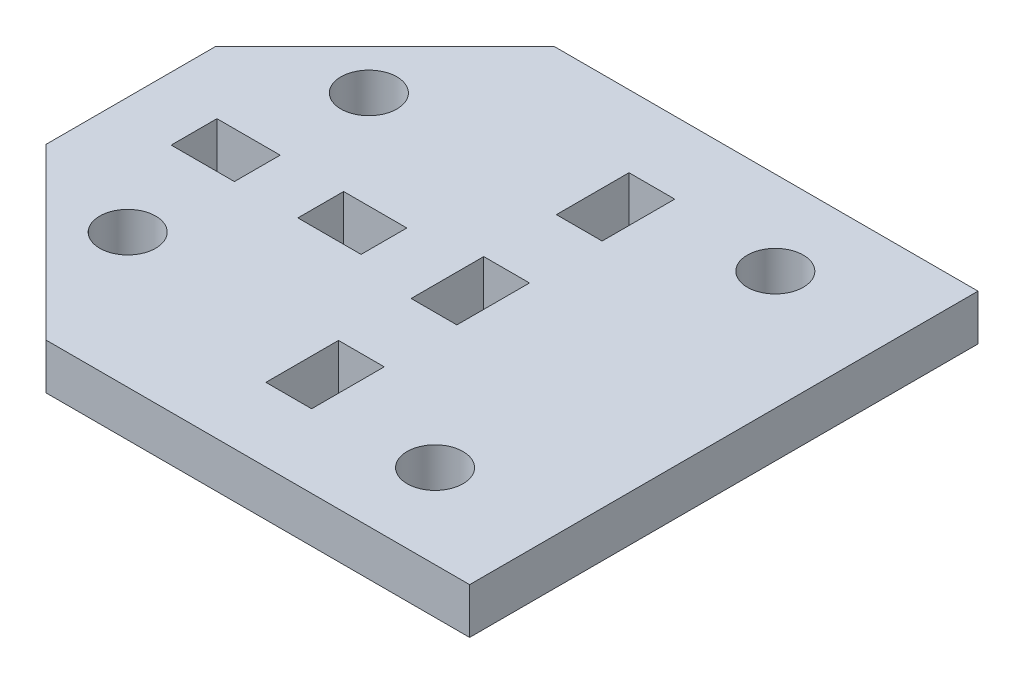
ISO-10303-21;
HEADER;
FILE_DESCRIPTION(('STEP AP214'),'2;1');
FILE_NAME('part.step','',(''),(''),'','','');
FILE_SCHEMA(('AUTOMOTIVE_DESIGN { 1 0 10303 214 1 1 1 1 }'));
ENDSEC;
DATA;
#1=APPLICATION_CONTEXT('core data for automotive mechanical design processes');
#2=APPLICATION_PROTOCOL_DEFINITION('international standard','automotive_design',2000,#1);
#3=PRODUCT_CONTEXT('',#1,'mechanical');
#4=PRODUCT('Part','Part','',(#3));
#5=PRODUCT_RELATED_PRODUCT_CATEGORY('part','',(#4));
#6=PRODUCT_DEFINITION_FORMATION('','',#4);
#7=PRODUCT_DEFINITION_CONTEXT('part definition',#1,'design');
#8=PRODUCT_DEFINITION('design','',#6,#7);
#9=PRODUCT_DEFINITION_SHAPE('','',#8);
#10=(LENGTH_UNIT() NAMED_UNIT(*) SI_UNIT(.MILLI.,.METRE.));
#11=(NAMED_UNIT(*) PLANE_ANGLE_UNIT() SI_UNIT($,.RADIAN.));
#12=(NAMED_UNIT(*) SI_UNIT($,.STERADIAN.) SOLID_ANGLE_UNIT());
#13=UNCERTAINTY_MEASURE_WITH_UNIT(LENGTH_MEASURE(1.E-05),#10,'distance_accuracy_value','');
#14=(GEOMETRIC_REPRESENTATION_CONTEXT(3) GLOBAL_UNCERTAINTY_ASSIGNED_CONTEXT((#13)) GLOBAL_UNIT_ASSIGNED_CONTEXT((#10,
#11,#12)) REPRESENTATION_CONTEXT('',''));
#15=CARTESIAN_POINT('',(0.,0.,0.));
#16=DIRECTION('',(0.,0.,1.));
#17=DIRECTION('',(1.,0.,0.));
#18=AXIS2_PLACEMENT_3D('',#15,#16,#17);
#19=CARTESIAN_POINT('',(-19.2232959586997,-2.7,-4.05387286781135));
#20=DIRECTION('',(-0.707106781186547,0.,-0.707106781186547));
#21=DIRECTION('',(-0.707106781186548,0.,0.707106781186548));
#22=AXIS2_PLACEMENT_3D('',#19,#20,#21);
#23=PLANE('',#22);
#24=DIRECTION('',(-0.707106781186547,0.,0.707106781186547));
#25=VECTOR('',#24,1.);
#26=CARTESIAN_POINT('',(-19.2232959586997,0.,-4.05387286781135));
#27=LINE('',#26,#25);
#28=CARTESIAN_POINT('',(-9.22329595869969,0.,-14.0538728678113));
#29=VERTEX_POINT('',#28);
#30=CARTESIAN_POINT('',(-19.2232959586997,0.,-4.05387286781135));
#31=VERTEX_POINT('',#30);
#32=EDGE_CURVE('E391',#29,#31,#27,.T.);
#33=ORIENTED_EDGE('',*,*,#32,.F.);
#34=DIRECTION('',(0.,1.,0.));
#35=VECTOR('',#34,1.);
#36=CARTESIAN_POINT('',(-9.22329595869969,-2.7,-14.0538728678113));
#37=LINE('',#36,#35);
#38=CARTESIAN_POINT('',(-9.22329595869969,-2.7,-14.0538728678113));
#39=VERTEX_POINT('',#38);
#40=EDGE_CURVE('E11',#39,#29,#37,.T.);
#41=ORIENTED_EDGE('',*,*,#40,.F.);
#42=DIRECTION('',(-0.707106781186547,0.,0.707106781186547));
#43=VECTOR('',#42,1.);
#44=CARTESIAN_POINT('',(-19.2232959586997,-2.7,-4.05387286781135));
#45=LINE('',#44,#43);
#46=CARTESIAN_POINT('',(-19.2232959586997,-2.7,-4.05387286781135));
#47=VERTEX_POINT('',#46);
#48=EDGE_CURVE('E394',#39,#47,#45,.T.);
#49=ORIENTED_EDGE('',*,*,#48,.T.);
#50=DIRECTION('',(0.,1.,0.));
#51=VECTOR('',#50,1.);
#52=CARTESIAN_POINT('',(-19.2232959586997,-2.7,-4.05387286781135));
#53=LINE('',#52,#51);
#54=EDGE_CURVE('E35',#47,#31,#53,.T.);
#55=ORIENTED_EDGE('',*,*,#54,.T.);
#56=EDGE_LOOP('',(#33,#41,#49,#55));
#57=FACE_BOUND('',#56,.T.);
#58=ADVANCED_FACE('F32',(#57),#23,.T.);
#59=CARTESIAN_POINT('',(10.7767040413003,-2.7,-14.0538728678113));
#60=DIRECTION('',(0.,0.,-1.));
#61=DIRECTION('',(-1.,0.,0.));
#62=AXIS2_PLACEMENT_3D('',#59,#60,#61);
#63=PLANE('',#62);
#64=DIRECTION('',(-1.,0.,0.));
#65=VECTOR('',#64,1.);
#66=CARTESIAN_POINT('',(10.7767040413003,0.,-14.0538728678113));
#67=LINE('',#66,#65);
#68=CARTESIAN_POINT('',(15.7767040413003,0.,-14.0538728678113));
#69=VERTEX_POINT('',#68);
#70=EDGE_CURVE('E398',#69,#29,#67,.T.);
#71=ORIENTED_EDGE('',*,*,#70,.F.);
#72=DIRECTION('',(0.,1.,0.));
#73=VECTOR('',#72,1.);
#74=CARTESIAN_POINT('',(15.7767040413003,-2.7,-14.0538728678113));
#75=LINE('',#74,#73);
#76=CARTESIAN_POINT('',(15.7767040413003,-2.7,-14.0538728678113));
#77=VERTEX_POINT('',#76);
#78=EDGE_CURVE('E40',#77,#69,#75,.T.);
#79=ORIENTED_EDGE('',*,*,#78,.F.);
#80=DIRECTION('',(-1.,0.,0.));
#81=VECTOR('',#80,1.);
#82=CARTESIAN_POINT('',(10.7767040413003,-2.7,-14.0538728678113));
#83=LINE('',#82,#81);
#84=EDGE_CURVE('E409',#77,#39,#83,.T.);
#85=ORIENTED_EDGE('',*,*,#84,.T.);
#86=ORIENTED_EDGE('',*,*,#40,.T.);
#87=EDGE_LOOP('',(#71,#79,#85,#86));
#88=FACE_BOUND('',#87,.T.);
#89=ADVANCED_FACE('F447',(#88),#63,.T.);
#90=CARTESIAN_POINT('',(15.7767040413003,-2.7,-14.0538728678113));
#91=DIRECTION('',(1.,0.,0.));
#92=DIRECTION('',(0.,0.,-1.));
#93=AXIS2_PLACEMENT_3D('',#90,#91,#92);
#94=PLANE('',#93);
#95=DIRECTION('',(0.,0.,-1.));
#96=VECTOR('',#95,1.);
#97=CARTESIAN_POINT('',(15.7767040413003,0.,-14.0538728678113));
#98=LINE('',#97,#96);
#99=CARTESIAN_POINT('',(15.7767040413003,0.,15.9461271321887));
#100=VERTEX_POINT('',#99);
#101=EDGE_CURVE('E422',#100,#69,#98,.T.);
#102=ORIENTED_EDGE('',*,*,#101,.F.);
#103=DIRECTION('',(0.,1.,0.));
#104=VECTOR('',#103,1.);
#105=CARTESIAN_POINT('',(15.7767040413003,-2.7,15.9461271321887));
#106=LINE('',#105,#104);
#107=CARTESIAN_POINT('',(15.7767040413003,-2.7,15.9461271321887));
#108=VERTEX_POINT('',#107);
#109=EDGE_CURVE('E429',#108,#100,#106,.T.);
#110=ORIENTED_EDGE('',*,*,#109,.F.);
#111=DIRECTION('',(0.,0.,-1.));
#112=VECTOR('',#111,1.);
#113=CARTESIAN_POINT('',(15.7767040413003,-2.7,-14.0538728678113));
#114=LINE('',#113,#112);
#115=EDGE_CURVE('E406',#108,#77,#114,.T.);
#116=ORIENTED_EDGE('',*,*,#115,.T.);
#117=ORIENTED_EDGE('',*,*,#78,.T.);
#118=EDGE_LOOP('',(#102,#110,#116,#117));
#119=FACE_BOUND('',#118,.T.);
#120=ADVANCED_FACE('F450',(#119),#94,.T.);
#121=CARTESIAN_POINT('',(15.7767040413003,-2.7,15.9461271321887));
#122=DIRECTION('',(0.,0.,1.));
#123=DIRECTION('',(1.,0.,0.));
#124=AXIS2_PLACEMENT_3D('',#121,#122,#123);
#125=PLANE('',#124);
#126=DIRECTION('',(1.,0.,0.));
#127=VECTOR('',#126,1.);
#128=CARTESIAN_POINT('',(15.7767040413003,0.,15.9461271321887));
#129=LINE('',#128,#127);
#130=CARTESIAN_POINT('',(-9.22329595869968,0.,15.9461271321887));
#131=VERTEX_POINT('',#130);
#132=EDGE_CURVE('E419',#131,#100,#129,.T.);
#133=ORIENTED_EDGE('',*,*,#132,.F.);
#134=DIRECTION('',(0.,1.,0.));
#135=VECTOR('',#134,1.);
#136=CARTESIAN_POINT('',(-9.22329595869968,-2.7,15.9461271321887));
#137=LINE('',#136,#135);
#138=CARTESIAN_POINT('',(-9.22329595869968,-2.7,15.9461271321887));
#139=VERTEX_POINT('',#138);
#140=EDGE_CURVE('E431',#139,#131,#137,.T.);
#141=ORIENTED_EDGE('',*,*,#140,.F.);
#142=DIRECTION('',(1.,0.,0.));
#143=VECTOR('',#142,1.);
#144=CARTESIAN_POINT('',(10.7767040413003,-2.7,15.9461271321887));
#145=LINE('',#144,#143);
#146=EDGE_CURVE('E404',#139,#108,#145,.T.);
#147=ORIENTED_EDGE('',*,*,#146,.T.);
#148=ORIENTED_EDGE('',*,*,#109,.T.);
#149=EDGE_LOOP('',(#133,#141,#147,#148));
#150=FACE_BOUND('',#149,.T.);
#151=ADVANCED_FACE('F459',(#150),#125,.T.);
#152=CARTESIAN_POINT('',(-9.22329595869968,-2.7,15.9461271321887));
#153=DIRECTION('',(-0.707106781186547,0.,0.707106781186547));
#154=DIRECTION('',(0.707106781186548,0.,0.707106781186548));
#155=AXIS2_PLACEMENT_3D('',#152,#153,#154);
#156=PLANE('',#155);
#157=DIRECTION('',(0.707106781186548,0.,0.707106781186548));
#158=VECTOR('',#157,1.);
#159=CARTESIAN_POINT('',(-9.22329595869968,0.,15.9461271321887));
#160=LINE('',#159,#158);
#161=CARTESIAN_POINT('',(-19.2232959586997,0.,5.94612713218866));
#162=VERTEX_POINT('',#161);
#163=EDGE_CURVE('E416',#162,#131,#160,.T.);
#164=ORIENTED_EDGE('',*,*,#163,.F.);
#165=DIRECTION('',(0.,1.,0.));
#166=VECTOR('',#165,1.);
#167=CARTESIAN_POINT('',(-19.2232959586997,-2.7,5.94612713218866));
#168=LINE('',#167,#166);
#169=CARTESIAN_POINT('',(-19.2232959586997,-2.7,5.94612713218866));
#170=VERTEX_POINT('',#169);
#171=EDGE_CURVE('E433',#170,#162,#168,.T.);
#172=ORIENTED_EDGE('',*,*,#171,.F.);
#173=DIRECTION('',(0.707106781186548,0.,0.707106781186548));
#174=VECTOR('',#173,1.);
#175=CARTESIAN_POINT('',(-9.22329595869968,-2.7,15.9461271321887));
#176=LINE('',#175,#174);
#177=EDGE_CURVE('E401',#170,#139,#176,.T.);
#178=ORIENTED_EDGE('',*,*,#177,.T.);
#179=ORIENTED_EDGE('',*,*,#140,.T.);
#180=EDGE_LOOP('',(#164,#172,#178,#179));
#181=FACE_BOUND('',#180,.T.);
#182=ADVANCED_FACE('F457',(#181),#156,.T.);
#183=CARTESIAN_POINT('',(-19.2232959586997,-2.7,-4.05387286781135));
#184=DIRECTION('',(-1.,0.,0.));
#185=DIRECTION('',(0.,0.,1.));
#186=AXIS2_PLACEMENT_3D('',#183,#184,#185);
#187=PLANE('',#186);
#188=DIRECTION('',(0.,0.,1.));
#189=VECTOR('',#188,1.);
#190=CARTESIAN_POINT('',(-19.2232959586997,0.,-4.05387286781135));
#191=LINE('',#190,#189);
#192=EDGE_CURVE('E413',#31,#162,#191,.T.);
#193=ORIENTED_EDGE('',*,*,#192,.F.);
#194=ORIENTED_EDGE('',*,*,#54,.F.);
#195=DIRECTION('',(0.,0.,1.));
#196=VECTOR('',#195,1.);
#197=CARTESIAN_POINT('',(-19.2232959586997,-2.7,-4.05387286781135));
#198=LINE('',#197,#196);
#199=EDGE_CURVE('E397',#47,#170,#198,.T.);
#200=ORIENTED_EDGE('',*,*,#199,.T.);
#201=ORIENTED_EDGE('',*,*,#171,.T.);
#202=EDGE_LOOP('',(#193,#194,#200,#201));
#203=FACE_BOUND('',#202,.T.);
#204=ADVANCED_FACE('F442',(#203),#187,.T.);
#205=CARTESIAN_POINT('',(0.,-2.7,0.));
#206=DIRECTION('',(0.,1.,0.));
#207=DIRECTION('',(0.,0.,1.));
#208=AXIS2_PLACEMENT_3D('',#205,#206,#207);
#209=PLANE('',#208);
#210=DIRECTION('',(-1.,0.,0.));
#211=VECTOR('',#210,1.);
#212=CARTESIAN_POINT('',(-8.03329595869972,-2.7,-0.427856318214311));
#213=LINE('',#212,#211);
#214=CARTESIAN_POINT('',(-4.30329595869973,-2.7,-0.427856318214312));
#215=VERTEX_POINT('',#214);
#216=CARTESIAN_POINT('',(-8.03329595869972,-2.7,-0.427856318214311));
#217=VERTEX_POINT('',#216);
#218=EDGE_CURVE('E213',#215,#217,#213,.T.);
#219=ORIENTED_EDGE('',*,*,#218,.T.);
#220=DIRECTION('',(0.,0.,1.));
#221=VECTOR('',#220,1.);
#222=CARTESIAN_POINT('',(-8.03329595869972,-2.7,-0.427856318214311));
#223=LINE('',#222,#221);
#224=CARTESIAN_POINT('',(-8.03329595869972,-2.7,2.27214368178569));
#225=VERTEX_POINT('',#224);
#226=EDGE_CURVE('E207',#217,#225,#223,.T.);
#227=ORIENTED_EDGE('',*,*,#226,.T.);
#228=DIRECTION('',(1.,0.,0.));
#229=VECTOR('',#228,1.);
#230=CARTESIAN_POINT('',(-8.03329595869972,-2.7,2.27214368178569));
#231=LINE('',#230,#229);
#232=CARTESIAN_POINT('',(-4.30329595869973,-2.7,2.27214368178569));
#233=VERTEX_POINT('',#232);
#234=EDGE_CURVE('E216',#225,#233,#231,.T.);
#235=ORIENTED_EDGE('',*,*,#234,.T.);
#236=DIRECTION('',(0.,0.,-1.));
#237=VECTOR('',#236,1.);
#238=CARTESIAN_POINT('',(-4.30329595869973,-2.7,-0.427856318214312));
#239=LINE('',#238,#237);
#240=EDGE_CURVE('E48',#233,#215,#239,.T.);
#241=ORIENTED_EDGE('',*,*,#240,.T.);
#242=EDGE_LOOP('',(#219,#227,#235,#241));
#243=FACE_BOUND('',#242,.T.);
#244=DIRECTION('',(0.,0.,1.));
#245=VECTOR('',#244,1.);
#246=CARTESIAN_POINT('',(-0.573295958699741,-2.7,-5.52241671372105));
#247=LINE('',#246,#245);
#248=CARTESIAN_POINT('',(-0.573295958699741,-2.7,-9.80813099943533));
#249=VERTEX_POINT('',#248);
#250=CARTESIAN_POINT('',(-0.573295958699741,-2.7,-5.52241671372105));
#251=VERTEX_POINT('',#250);
#252=EDGE_CURVE('E252',#249,#251,#247,.T.);
#253=ORIENTED_EDGE('',*,*,#252,.T.);
#254=DIRECTION('',(1.,0.,0.));
#255=VECTOR('',#254,1.);
#256=CARTESIAN_POINT('',(2.12670404130037,-2.7,-5.52241671372106));
#257=LINE('',#256,#255);
#258=CARTESIAN_POINT('',(2.12670404130037,-2.7,-5.52241671372106));
#259=VERTEX_POINT('',#258);
#260=EDGE_CURVE('E242',#251,#259,#257,.T.);
#261=ORIENTED_EDGE('',*,*,#260,.T.);
#262=DIRECTION('',(0.,0.,-1.));
#263=VECTOR('',#262,1.);
#264=CARTESIAN_POINT('',(2.12670404130037,-2.7,-5.52241671372106));
#265=LINE('',#264,#263);
#266=CARTESIAN_POINT('',(2.12670404130037,-2.7,-9.80813099943535));
#267=VERTEX_POINT('',#266);
#268=EDGE_CURVE('E245',#259,#267,#265,.T.);
#269=ORIENTED_EDGE('',*,*,#268,.T.);
#270=DIRECTION('',(-1.,0.,0.));
#271=VECTOR('',#270,1.);
#272=CARTESIAN_POINT('',(-0.573295958699741,-2.7,-9.80813099943533));
#273=LINE('',#272,#271);
#274=EDGE_CURVE('E249',#267,#249,#273,.T.);
#275=ORIENTED_EDGE('',*,*,#274,.T.);
#276=EDGE_LOOP('',(#253,#261,#269,#275));
#277=FACE_BOUND('',#276,.T.);
#278=DIRECTION('',(-1.,0.,0.));
#279=VECTOR('',#278,1.);
#280=CARTESIAN_POINT('',(-15.4932959586997,-2.7,-0.411867351278998));
#281=LINE('',#280,#279);
#282=CARTESIAN_POINT('',(-11.7632959586997,-2.7,-0.411867351278998));
#283=VERTEX_POINT('',#282);
#284=CARTESIAN_POINT('',(-15.4932959586997,-2.7,-0.411867351278998));
#285=VERTEX_POINT('',#284);
#286=EDGE_CURVE('E284',#283,#285,#281,.T.);
#287=ORIENTED_EDGE('',*,*,#286,.T.);
#288=DIRECTION('',(0.,0.,1.));
#289=VECTOR('',#288,1.);
#290=CARTESIAN_POINT('',(-15.4932959586997,-2.7,2.288132648721));
#291=LINE('',#290,#289);
#292=CARTESIAN_POINT('',(-15.4932959586997,-2.7,2.288132648721));
#293=VERTEX_POINT('',#292);
#294=EDGE_CURVE('E274',#285,#293,#291,.T.);
#295=ORIENTED_EDGE('',*,*,#294,.T.);
#296=DIRECTION('',(1.,0.,0.));
#297=VECTOR('',#296,1.);
#298=CARTESIAN_POINT('',(-15.4932959586997,-2.7,2.288132648721));
#299=LINE('',#298,#297);
#300=CARTESIAN_POINT('',(-11.7632959586997,-2.7,2.288132648721));
#301=VERTEX_POINT('',#300);
#302=EDGE_CURVE('E277',#293,#301,#299,.T.);
#303=ORIENTED_EDGE('',*,*,#302,.T.);
#304=DIRECTION('',(0.,0.,-1.));
#305=VECTOR('',#304,1.);
#306=CARTESIAN_POINT('',(-11.7632959586997,-2.7,2.288132648721));
#307=LINE('',#306,#305);
#308=EDGE_CURVE('E281',#301,#283,#307,.T.);
#309=ORIENTED_EDGE('',*,*,#308,.T.);
#310=EDGE_LOOP('',(#287,#295,#303,#309));
#311=FACE_BOUND('',#310,.T.);
#312=DIRECTION('',(0.,0.,1.));
#313=VECTOR('',#312,1.);
#314=CARTESIAN_POINT('',(-0.573295958699741,-2.7,3.04901185770752));
#315=LINE('',#314,#313);
#316=CARTESIAN_POINT('',(-0.573295958699741,-2.7,-1.23670242800676));
#317=VERTEX_POINT('',#316);
#318=CARTESIAN_POINT('',(-0.573295958699741,-2.7,3.04901185770752));
#319=VERTEX_POINT('',#318);
#320=EDGE_CURVE('E316',#317,#319,#315,.T.);
#321=ORIENTED_EDGE('',*,*,#320,.T.);
#322=DIRECTION('',(1.,0.,0.));
#323=VECTOR('',#322,1.);
#324=CARTESIAN_POINT('',(2.12670404130037,-2.7,3.04901185770752));
#325=LINE('',#324,#323);
#326=CARTESIAN_POINT('',(2.12670404130037,-2.7,3.04901185770752));
#327=VERTEX_POINT('',#326);
#328=EDGE_CURVE('E306',#319,#327,#325,.T.);
#329=ORIENTED_EDGE('',*,*,#328,.T.);
#330=DIRECTION('',(0.,0.,-1.));
#331=VECTOR('',#330,1.);
#332=CARTESIAN_POINT('',(2.12670404130037,-2.7,3.04901185770752));
#333=LINE('',#332,#331);
#334=CARTESIAN_POINT('',(2.12670404130037,-2.7,-1.23670242800677));
#335=VERTEX_POINT('',#334);
#336=EDGE_CURVE('E309',#327,#335,#333,.T.);
#337=ORIENTED_EDGE('',*,*,#336,.T.);
#338=DIRECTION('',(-1.,0.,0.));
#339=VECTOR('',#338,1.);
#340=CARTESIAN_POINT('',(-0.573295958699741,-2.7,-1.23670242800676));
#341=LINE('',#340,#339);
#342=EDGE_CURVE('E313',#335,#317,#341,.T.);
#343=ORIENTED_EDGE('',*,*,#342,.T.);
#344=EDGE_LOOP('',(#321,#329,#337,#343));
#345=FACE_BOUND('',#344,.T.);
#346=CARTESIAN_POINT('',(-12.3261807698797,-2.7,-6.21069187463407));
#347=DIRECTION('',(0.,1.,0.));
#348=DIRECTION('',(0.,0.,-1.));
#349=AXIS2_PLACEMENT_3D('',#346,#347,#348);
#350=CIRCLE('',#349,1.64999999999976);
#351=CARTESIAN_POINT('',(-12.3261807698797,-2.7,-7.86069187463383));
#352=VERTEX_POINT('',#351);
#353=EDGE_CURVE('E338',#352,#352,#350,.T.);
#354=ORIENTED_EDGE('',*,*,#353,.T.);
#355=EDGE_LOOP('',(#354));
#356=FACE_BOUND('',#355,.T.);
#357=DIRECTION('',(0.,0.,1.));
#358=VECTOR('',#357,1.);
#359=CARTESIAN_POINT('',(-0.573295958699741,-2.7,11.6204404291361));
#360=LINE('',#359,#358);
#361=CARTESIAN_POINT('',(-0.573295958699741,-2.7,7.3347261434218));
#362=VERTEX_POINT('',#361);
#363=CARTESIAN_POINT('',(-0.573295958699741,-2.7,11.6204404291361));
#364=VERTEX_POINT('',#363);
#365=EDGE_CURVE('E354',#362,#364,#360,.T.);
#366=ORIENTED_EDGE('',*,*,#365,.T.);
#367=DIRECTION('',(1.,0.,0.));
#368=VECTOR('',#367,1.);
#369=CARTESIAN_POINT('',(-0.573295958699741,-2.7,11.6204404291361));
#370=LINE('',#369,#368);
#371=CARTESIAN_POINT('',(2.12670404130037,-2.7,11.6204404291361));
#372=VERTEX_POINT('',#371);
#373=EDGE_CURVE('E344',#364,#372,#370,.T.);
#374=ORIENTED_EDGE('',*,*,#373,.T.);
#375=DIRECTION('',(0.,0.,-1.));
#376=VECTOR('',#375,1.);
#377=CARTESIAN_POINT('',(2.12670404130037,-2.7,11.6204404291361));
#378=LINE('',#377,#376);
#379=CARTESIAN_POINT('',(2.12670404130037,-2.7,7.3347261434218));
#380=VERTEX_POINT('',#379);
#381=EDGE_CURVE('E347',#372,#380,#378,.T.);
#382=ORIENTED_EDGE('',*,*,#381,.T.);
#383=DIRECTION('',(-1.,0.,0.));
#384=VECTOR('',#383,1.);
#385=CARTESIAN_POINT('',(-0.573295958699741,-2.7,7.3347261434218));
#386=LINE('',#385,#384);
#387=EDGE_CURVE('E351',#380,#362,#386,.T.);
#388=ORIENTED_EDGE('',*,*,#387,.T.);
#389=EDGE_LOOP('',(#366,#374,#382,#388));
#390=FACE_BOUND('',#389,.T.);
#391=CARTESIAN_POINT('',(8.77670404130031,-2.7,10.9860995495269));
#392=DIRECTION('',(0.,1.,0.));
#393=DIRECTION('',(0.,0.,-1.));
#394=AXIS2_PLACEMENT_3D('',#391,#392,#393);
#395=CIRCLE('',#394,1.65);
#396=CARTESIAN_POINT('',(8.77670404130031,-2.7,9.33609954952694));
#397=VERTEX_POINT('',#396);
#398=EDGE_CURVE('E376',#397,#397,#395,.T.);
#399=ORIENTED_EDGE('',*,*,#398,.T.);
#400=EDGE_LOOP('',(#399));
#401=FACE_BOUND('',#400,.T.);
#402=CARTESIAN_POINT('',(8.77670404130031,-2.7,-9.09384528514964));
#403=DIRECTION('',(0.,1.,0.));
#404=DIRECTION('',(0.,0.,1.));
#405=AXIS2_PLACEMENT_3D('',#402,#403,#404);
#406=CIRCLE('',#405,1.65);
#407=CARTESIAN_POINT('',(8.77670404130031,-2.7,-7.44384528514964));
#408=VERTEX_POINT('',#407);
#409=EDGE_CURVE('E382',#408,#408,#406,.T.);
#410=ORIENTED_EDGE('',*,*,#409,.T.);
#411=EDGE_LOOP('',(#410));
#412=FACE_BOUND('',#411,.T.);
#413=CARTESIAN_POINT('',(-12.3261807698797,-2.7,8.0230013043348));
#414=DIRECTION('',(0.,1.,0.));
#415=DIRECTION('',(0.,0.,1.));
#416=AXIS2_PLACEMENT_3D('',#413,#414,#415);
#417=CIRCLE('',#416,1.64999999999976);
#418=CARTESIAN_POINT('',(-12.3261807698797,-2.7,9.67300130433457));
#419=VERTEX_POINT('',#418);
#420=EDGE_CURVE('E388',#419,#419,#417,.T.);
#421=ORIENTED_EDGE('',*,*,#420,.T.);
#422=EDGE_LOOP('',(#421));
#423=FACE_BOUND('',#422,.T.);
#424=ORIENTED_EDGE('',*,*,#48,.F.);
#425=ORIENTED_EDGE('',*,*,#84,.F.);
#426=ORIENTED_EDGE('',*,*,#115,.F.);
#427=ORIENTED_EDGE('',*,*,#146,.F.);
#428=ORIENTED_EDGE('',*,*,#177,.F.);
#429=ORIENTED_EDGE('',*,*,#199,.F.);
#430=EDGE_LOOP('',(#424,#425,#426,#427,#428,#429));
#431=FACE_BOUND('',#430,.T.);
#432=ADVANCED_FACE('F220',(#243,#277,#311,#345,#356,#390,#401,#412,#423,#431),#209,.F.);
#433=CARTESIAN_POINT('',(0.,0.,0.));
#434=DIRECTION('',(0.,1.,0.));
#435=DIRECTION('',(0.,0.,1.));
#436=AXIS2_PLACEMENT_3D('',#433,#434,#435);
#437=PLANE('',#436);
#438=DIRECTION('',(0.,0.,1.));
#439=VECTOR('',#438,1.);
#440=CARTESIAN_POINT('',(-8.03329595869972,0.,-0.427856318214311));
#441=LINE('',#440,#439);
#442=CARTESIAN_POINT('',(-8.03329595869972,0.,-0.427856318214311));
#443=VERTEX_POINT('',#442);
#444=CARTESIAN_POINT('',(-8.03329595869972,0.,2.27214368178569));
#445=VERTEX_POINT('',#444);
#446=EDGE_CURVE('E56',#443,#445,#441,.T.);
#447=ORIENTED_EDGE('',*,*,#446,.F.);
#448=DIRECTION('',(-1.,0.,0.));
#449=VECTOR('',#448,1.);
#450=CARTESIAN_POINT('',(-8.03329595869972,0.,-0.427856318214311));
#451=LINE('',#450,#449);
#452=CARTESIAN_POINT('',(-4.30329595869973,0.,-0.427856318214312));
#453=VERTEX_POINT('',#452);
#454=EDGE_CURVE('E223',#453,#443,#451,.T.);
#455=ORIENTED_EDGE('',*,*,#454,.F.);
#456=DIRECTION('',(0.,0.,-1.));
#457=VECTOR('',#456,1.);
#458=CARTESIAN_POINT('',(-4.30329595869973,0.,-0.427856318214312));
#459=LINE('',#458,#457);
#460=CARTESIAN_POINT('',(-4.30329595869973,0.,2.27214368178569));
#461=VERTEX_POINT('',#460);
#462=EDGE_CURVE('E226',#461,#453,#459,.T.);
#463=ORIENTED_EDGE('',*,*,#462,.F.);
#464=DIRECTION('',(1.,0.,0.));
#465=VECTOR('',#464,1.);
#466=CARTESIAN_POINT('',(-8.03329595869972,0.,2.27214368178569));
#467=LINE('',#466,#465);
#468=EDGE_CURVE('E232',#445,#461,#467,.T.);
#469=ORIENTED_EDGE('',*,*,#468,.F.);
#470=EDGE_LOOP('',(#447,#455,#463,#469));
#471=FACE_BOUND('',#470,.T.);
#472=DIRECTION('',(1.,0.,0.));
#473=VECTOR('',#472,1.);
#474=CARTESIAN_POINT('',(2.12670404130037,0.,-5.52241671372106));
#475=LINE('',#474,#473);
#476=CARTESIAN_POINT('',(-0.573295958699741,0.,-5.52241671372105));
#477=VERTEX_POINT('',#476);
#478=CARTESIAN_POINT('',(2.12670404130037,0.,-5.52241671372106));
#479=VERTEX_POINT('',#478);
#480=EDGE_CURVE('E238',#477,#479,#475,.T.);
#481=ORIENTED_EDGE('',*,*,#480,.F.);
#482=DIRECTION('',(0.,0.,1.));
#483=VECTOR('',#482,1.);
#484=CARTESIAN_POINT('',(-0.573295958699741,0.,-5.52241671372105));
#485=LINE('',#484,#483);
#486=CARTESIAN_POINT('',(-0.573295958699741,0.,-9.80813099943533));
#487=VERTEX_POINT('',#486);
#488=EDGE_CURVE('E246',#487,#477,#485,.T.);
#489=ORIENTED_EDGE('',*,*,#488,.F.);
#490=DIRECTION('',(-1.,0.,0.));
#491=VECTOR('',#490,1.);
#492=CARTESIAN_POINT('',(-0.573295958699741,0.,-9.80813099943533));
#493=LINE('',#492,#491);
#494=CARTESIAN_POINT('',(2.12670404130037,0.,-9.80813099943535));
#495=VERTEX_POINT('',#494);
#496=EDGE_CURVE('E260',#495,#487,#493,.T.);
#497=ORIENTED_EDGE('',*,*,#496,.F.);
#498=DIRECTION('',(0.,0.,-1.));
#499=VECTOR('',#498,1.);
#500=CARTESIAN_POINT('',(2.12670404130037,0.,-5.52241671372106));
#501=LINE('',#500,#499);
#502=EDGE_CURVE('E257',#479,#495,#501,.T.);
#503=ORIENTED_EDGE('',*,*,#502,.F.);
#504=EDGE_LOOP('',(#481,#489,#497,#503));
#505=FACE_BOUND('',#504,.T.);
#506=DIRECTION('',(0.,0.,1.));
#507=VECTOR('',#506,1.);
#508=CARTESIAN_POINT('',(-15.4932959586997,0.,2.288132648721));
#509=LINE('',#508,#507);
#510=CARTESIAN_POINT('',(-15.4932959586997,0.,-0.411867351278998));
#511=VERTEX_POINT('',#510);
#512=CARTESIAN_POINT('',(-15.4932959586997,0.,2.288132648721));
#513=VERTEX_POINT('',#512);
#514=EDGE_CURVE('E267',#511,#513,#509,.T.);
#515=ORIENTED_EDGE('',*,*,#514,.F.);
#516=DIRECTION('',(-1.,0.,0.));
#517=VECTOR('',#516,1.);
#518=CARTESIAN_POINT('',(-15.4932959586997,0.,-0.411867351278998));
#519=LINE('',#518,#517);
#520=CARTESIAN_POINT('',(-11.7632959586997,0.,-0.411867351278998));
#521=VERTEX_POINT('',#520);
#522=EDGE_CURVE('E278',#521,#511,#519,.T.);
#523=ORIENTED_EDGE('',*,*,#522,.F.);
#524=DIRECTION('',(0.,0.,-1.));
#525=VECTOR('',#524,1.);
#526=CARTESIAN_POINT('',(-11.7632959586997,0.,2.288132648721));
#527=LINE('',#526,#525);
#528=CARTESIAN_POINT('',(-11.7632959586997,0.,2.288132648721));
#529=VERTEX_POINT('',#528);
#530=EDGE_CURVE('E292',#529,#521,#527,.T.);
#531=ORIENTED_EDGE('',*,*,#530,.F.);
#532=DIRECTION('',(1.,0.,0.));
#533=VECTOR('',#532,1.);
#534=CARTESIAN_POINT('',(-15.4932959586997,0.,2.288132648721));
#535=LINE('',#534,#533);
#536=EDGE_CURVE('E289',#513,#529,#535,.T.);
#537=ORIENTED_EDGE('',*,*,#536,.F.);
#538=EDGE_LOOP('',(#515,#523,#531,#537));
#539=FACE_BOUND('',#538,.T.);
#540=DIRECTION('',(1.,0.,0.));
#541=VECTOR('',#540,1.);
#542=CARTESIAN_POINT('',(2.12670404130037,0.,3.04901185770752));
#543=LINE('',#542,#541);
#544=CARTESIAN_POINT('',(-0.573295958699741,0.,3.04901185770752));
#545=VERTEX_POINT('',#544);
#546=CARTESIAN_POINT('',(2.12670404130037,0.,3.04901185770752));
#547=VERTEX_POINT('',#546);
#548=EDGE_CURVE('E299',#545,#547,#543,.T.);
#549=ORIENTED_EDGE('',*,*,#548,.F.);
#550=DIRECTION('',(0.,0.,1.));
#551=VECTOR('',#550,1.);
#552=CARTESIAN_POINT('',(-0.573295958699741,0.,3.04901185770752));
#553=LINE('',#552,#551);
#554=CARTESIAN_POINT('',(-0.573295958699741,0.,-1.23670242800676));
#555=VERTEX_POINT('',#554);
#556=EDGE_CURVE('E310',#555,#545,#553,.T.);
#557=ORIENTED_EDGE('',*,*,#556,.F.);
#558=DIRECTION('',(-1.,0.,0.));
#559=VECTOR('',#558,1.);
#560=CARTESIAN_POINT('',(-0.573295958699741,0.,-1.23670242800676));
#561=LINE('',#560,#559);
#562=CARTESIAN_POINT('',(2.12670404130037,0.,-1.23670242800677));
#563=VERTEX_POINT('',#562);
#564=EDGE_CURVE('E324',#563,#555,#561,.T.);
#565=ORIENTED_EDGE('',*,*,#564,.F.);
#566=DIRECTION('',(0.,0.,-1.));
#567=VECTOR('',#566,1.);
#568=CARTESIAN_POINT('',(2.12670404130037,0.,3.04901185770752));
#569=LINE('',#568,#567);
#570=EDGE_CURVE('E321',#547,#563,#569,.T.);
#571=ORIENTED_EDGE('',*,*,#570,.F.);
#572=EDGE_LOOP('',(#549,#557,#565,#571));
#573=FACE_BOUND('',#572,.T.);
#574=CARTESIAN_POINT('',(-12.3261807698797,0.,-6.21069187463407));
#575=DIRECTION('',(0.,1.,0.));
#576=DIRECTION('',(0.,0.,-1.));
#577=AXIS2_PLACEMENT_3D('',#574,#575,#576);
#578=CIRCLE('',#577,1.64999999999976);
#579=CARTESIAN_POINT('',(-12.3261807698797,0.,-7.86069187463383));
#580=VERTEX_POINT('',#579);
#581=EDGE_CURVE('E331',#580,#580,#578,.T.);
#582=ORIENTED_EDGE('',*,*,#581,.F.);
#583=EDGE_LOOP('',(#582));
#584=FACE_BOUND('',#583,.T.);
#585=DIRECTION('',(1.,0.,0.));
#586=VECTOR('',#585,1.);
#587=CARTESIAN_POINT('',(-0.573295958699741,0.,11.6204404291361));
#588=LINE('',#587,#586);
#589=CARTESIAN_POINT('',(-0.573295958699741,0.,11.6204404291361));
#590=VERTEX_POINT('',#589);
#591=CARTESIAN_POINT('',(2.12670404130037,0.,11.6204404291361));
#592=VERTEX_POINT('',#591);
#593=EDGE_CURVE('E341',#590,#592,#588,.T.);
#594=ORIENTED_EDGE('',*,*,#593,.F.);
#595=DIRECTION('',(0.,0.,1.));
#596=VECTOR('',#595,1.);
#597=CARTESIAN_POINT('',(-0.573295958699741,0.,11.6204404291361));
#598=LINE('',#597,#596);
#599=CARTESIAN_POINT('',(-0.573295958699741,0.,7.3347261434218));
#600=VERTEX_POINT('',#599);
#601=EDGE_CURVE('E348',#600,#590,#598,.T.);
#602=ORIENTED_EDGE('',*,*,#601,.F.);
#603=DIRECTION('',(-1.,0.,0.));
#604=VECTOR('',#603,1.);
#605=CARTESIAN_POINT('',(-0.573295958699741,0.,7.3347261434218));
#606=LINE('',#605,#604);
#607=CARTESIAN_POINT('',(2.12670404130037,0.,7.3347261434218));
#608=VERTEX_POINT('',#607);
#609=EDGE_CURVE('E362',#608,#600,#606,.T.);
#610=ORIENTED_EDGE('',*,*,#609,.F.);
#611=DIRECTION('',(0.,0.,-1.));
#612=VECTOR('',#611,1.);
#613=CARTESIAN_POINT('',(2.12670404130037,0.,11.6204404291361));
#614=LINE('',#613,#612);
#615=EDGE_CURVE('E359',#592,#608,#614,.T.);
#616=ORIENTED_EDGE('',*,*,#615,.F.);
#617=EDGE_LOOP('',(#594,#602,#610,#616));
#618=FACE_BOUND('',#617,.T.);
#619=CARTESIAN_POINT('',(8.77670404130031,0.,10.9860995495269));
#620=DIRECTION('',(0.,1.,0.));
#621=DIRECTION('',(0.,0.,-1.));
#622=AXIS2_PLACEMENT_3D('',#619,#620,#621);
#623=CIRCLE('',#622,1.65);
#624=CARTESIAN_POINT('',(8.77670404130031,0.,9.33609954952694));
#625=VERTEX_POINT('',#624);
#626=EDGE_CURVE('E369',#625,#625,#623,.T.);
#627=ORIENTED_EDGE('',*,*,#626,.F.);
#628=EDGE_LOOP('',(#627));
#629=FACE_BOUND('',#628,.T.);
#630=CARTESIAN_POINT('',(8.77670404130031,0.,-9.09384528514964));
#631=DIRECTION('',(0.,1.,0.));
#632=DIRECTION('',(0.,0.,1.));
#633=AXIS2_PLACEMENT_3D('',#630,#631,#632);
#634=CIRCLE('',#633,1.65);
#635=CARTESIAN_POINT('',(8.77670404130031,0.,-7.44384528514964));
#636=VERTEX_POINT('',#635);
#637=EDGE_CURVE('E379',#636,#636,#634,.T.);
#638=ORIENTED_EDGE('',*,*,#637,.F.);
#639=EDGE_LOOP('',(#638));
#640=FACE_BOUND('',#639,.T.);
#641=CARTESIAN_POINT('',(-12.3261807698797,0.,8.0230013043348));
#642=DIRECTION('',(0.,1.,0.));
#643=DIRECTION('',(0.,0.,1.));
#644=AXIS2_PLACEMENT_3D('',#641,#642,#643);
#645=CIRCLE('',#644,1.64999999999976);
#646=CARTESIAN_POINT('',(-12.3261807698797,0.,9.67300130433457));
#647=VERTEX_POINT('',#646);
#648=EDGE_CURVE('E385',#647,#647,#645,.T.);
#649=ORIENTED_EDGE('',*,*,#648,.F.);
#650=EDGE_LOOP('',(#649));
#651=FACE_BOUND('',#650,.T.);
#652=ORIENTED_EDGE('',*,*,#32,.T.);
#653=ORIENTED_EDGE('',*,*,#192,.T.);
#654=ORIENTED_EDGE('',*,*,#163,.T.);
#655=ORIENTED_EDGE('',*,*,#132,.T.);
#656=ORIENTED_EDGE('',*,*,#101,.T.);
#657=ORIENTED_EDGE('',*,*,#70,.T.);
#658=EDGE_LOOP('',(#652,#653,#654,#655,#656,#657));
#659=FACE_BOUND('',#658,.T.);
#660=ADVANCED_FACE('F444',(#471,#505,#539,#573,#584,#618,#629,#640,#651,#659),#437,.T.);
#661=CARTESIAN_POINT('',(-12.3261807698797,-2.7,8.0230013043348));
#662=DIRECTION('',(0.,1.,0.));
#663=DIRECTION('',(0.,0.,1.));
#664=AXIS2_PLACEMENT_3D('',#661,#662,#663);
#665=CYLINDRICAL_SURFACE('',#664,1.64999999999976);
#666=ORIENTED_EDGE('',*,*,#420,.F.);
#667=EDGE_LOOP('',(#666));
#668=FACE_BOUND('',#667,.T.);
#669=ORIENTED_EDGE('',*,*,#648,.T.);
#670=EDGE_LOOP('',(#669));
#671=FACE_BOUND('',#670,.T.);
#672=ADVANCED_FACE('F478',(#668,#671),#665,.F.);
#673=CARTESIAN_POINT('',(8.77670404130031,-2.7,-9.09384528514964));
#674=DIRECTION('',(0.,1.,0.));
#675=DIRECTION('',(0.,0.,1.));
#676=AXIS2_PLACEMENT_3D('',#673,#674,#675);
#677=CYLINDRICAL_SURFACE('',#676,1.65);
#678=ORIENTED_EDGE('',*,*,#409,.F.);
#679=EDGE_LOOP('',(#678));
#680=FACE_BOUND('',#679,.T.);
#681=ORIENTED_EDGE('',*,*,#637,.T.);
#682=EDGE_LOOP('',(#681));
#683=FACE_BOUND('',#682,.T.);
#684=ADVANCED_FACE('F484',(#680,#683),#677,.F.);
#685=CARTESIAN_POINT('',(8.77670404130031,-2.7,10.9860995495269));
#686=DIRECTION('',(0.,1.,0.));
#687=DIRECTION('',(0.,0.,1.));
#688=AXIS2_PLACEMENT_3D('',#685,#686,#687);
#689=CYLINDRICAL_SURFACE('',#688,1.65);
#690=ORIENTED_EDGE('',*,*,#398,.F.);
#691=EDGE_LOOP('',(#690));
#692=FACE_BOUND('',#691,.T.);
#693=ORIENTED_EDGE('',*,*,#626,.T.);
#694=EDGE_LOOP('',(#693));
#695=FACE_BOUND('',#694,.T.);
#696=ADVANCED_FACE('F488',(#692,#695),#689,.F.);
#697=CARTESIAN_POINT('',(-0.573295958699741,-2.7,11.6204404291361));
#698=DIRECTION('',(0.,0.,1.));
#699=DIRECTION('',(1.,0.,0.));
#700=AXIS2_PLACEMENT_3D('',#697,#698,#699);
#701=PLANE('',#700);
#702=ORIENTED_EDGE('',*,*,#593,.T.);
#703=DIRECTION('',(0.,1.,0.));
#704=VECTOR('',#703,1.);
#705=CARTESIAN_POINT('',(2.12670404130037,-2.7,11.6204404291361));
#706=LINE('',#705,#704);
#707=EDGE_CURVE('E357',#372,#592,#706,.T.);
#708=ORIENTED_EDGE('',*,*,#707,.F.);
#709=ORIENTED_EDGE('',*,*,#373,.F.);
#710=DIRECTION('',(0.,1.,0.));
#711=VECTOR('',#710,1.);
#712=CARTESIAN_POINT('',(-0.573295958699741,-2.7,11.6204404291361));
#713=LINE('',#712,#711);
#714=EDGE_CURVE('E367',#364,#590,#713,.T.);
#715=ORIENTED_EDGE('',*,*,#714,.T.);
#716=EDGE_LOOP('',(#702,#708,#709,#715));
#717=FACE_BOUND('',#716,.T.);
#718=ADVANCED_FACE('F492',(#717),#701,.F.);
#719=CARTESIAN_POINT('',(-0.573295958699741,-2.7,11.6204404291361));
#720=DIRECTION('',(-1.,0.,0.));
#721=DIRECTION('',(0.,0.,1.));
#722=AXIS2_PLACEMENT_3D('',#719,#720,#721);
#723=PLANE('',#722);
#724=ORIENTED_EDGE('',*,*,#601,.T.);
#725=ORIENTED_EDGE('',*,*,#714,.F.);
#726=ORIENTED_EDGE('',*,*,#365,.F.);
#727=DIRECTION('',(0.,1.,0.));
#728=VECTOR('',#727,1.);
#729=CARTESIAN_POINT('',(-0.573295958699741,-2.7,7.3347261434218));
#730=LINE('',#729,#728);
#731=EDGE_CURVE('E370',#362,#600,#730,.T.);
#732=ORIENTED_EDGE('',*,*,#731,.T.);
#733=EDGE_LOOP('',(#724,#725,#726,#732));
#734=FACE_BOUND('',#733,.T.);
#735=ADVANCED_FACE('F496',(#734),#723,.F.);
#736=CARTESIAN_POINT('',(-0.573295958699741,-2.7,7.3347261434218));
#737=DIRECTION('',(0.,0.,-1.));
#738=DIRECTION('',(-1.,0.,0.));
#739=AXIS2_PLACEMENT_3D('',#736,#737,#738);
#740=PLANE('',#739);
#741=ORIENTED_EDGE('',*,*,#609,.T.);
#742=ORIENTED_EDGE('',*,*,#731,.F.);
#743=ORIENTED_EDGE('',*,*,#387,.F.);
#744=DIRECTION('',(0.,1.,0.));
#745=VECTOR('',#744,1.);
#746=CARTESIAN_POINT('',(2.12670404130037,-2.7,7.3347261434218));
#747=LINE('',#746,#745);
#748=EDGE_CURVE('E372',#380,#608,#747,.T.);
#749=ORIENTED_EDGE('',*,*,#748,.T.);
#750=EDGE_LOOP('',(#741,#742,#743,#749));
#751=FACE_BOUND('',#750,.T.);
#752=ADVANCED_FACE('F502',(#751),#740,.F.);
#753=CARTESIAN_POINT('',(2.12670404130037,-2.7,11.6204404291361));
#754=DIRECTION('',(1.,0.,0.));
#755=DIRECTION('',(0.,0.,-1.));
#756=AXIS2_PLACEMENT_3D('',#753,#754,#755);
#757=PLANE('',#756);
#758=ORIENTED_EDGE('',*,*,#615,.T.);
#759=ORIENTED_EDGE('',*,*,#748,.F.);
#760=ORIENTED_EDGE('',*,*,#381,.F.);
#761=ORIENTED_EDGE('',*,*,#707,.T.);
#762=EDGE_LOOP('',(#758,#759,#760,#761));
#763=FACE_BOUND('',#762,.T.);
#764=ADVANCED_FACE('F498',(#763),#757,.F.);
#765=CARTESIAN_POINT('',(-12.3261807698797,-2.7,-6.21069187463407));
#766=DIRECTION('',(0.,1.,0.));
#767=DIRECTION('',(0.,0.,1.));
#768=AXIS2_PLACEMENT_3D('',#765,#766,#767);
#769=CYLINDRICAL_SURFACE('',#768,1.64999999999976);
#770=ORIENTED_EDGE('',*,*,#353,.F.);
#771=EDGE_LOOP('',(#770));
#772=FACE_BOUND('',#771,.T.);
#773=ORIENTED_EDGE('',*,*,#581,.T.);
#774=EDGE_LOOP('',(#773));
#775=FACE_BOUND('',#774,.T.);
#776=ADVANCED_FACE('F501',(#772,#775),#769,.F.);
#777=CARTESIAN_POINT('',(2.12670404130037,-2.7,3.04901185770752));
#778=DIRECTION('',(0.,0.,1.));
#779=DIRECTION('',(1.,0.,0.));
#780=AXIS2_PLACEMENT_3D('',#777,#778,#779);
#781=PLANE('',#780);
#782=ORIENTED_EDGE('',*,*,#548,.T.);
#783=DIRECTION('',(0.,1.,0.));
#784=VECTOR('',#783,1.);
#785=CARTESIAN_POINT('',(2.12670404130037,-2.7,3.04901185770752));
#786=LINE('',#785,#784);
#787=EDGE_CURVE('E319',#327,#547,#786,.T.);
#788=ORIENTED_EDGE('',*,*,#787,.F.);
#789=ORIENTED_EDGE('',*,*,#328,.F.);
#790=DIRECTION('',(0.,1.,0.));
#791=VECTOR('',#790,1.);
#792=CARTESIAN_POINT('',(-0.573295958699741,-2.7,3.04901185770752));
#793=LINE('',#792,#791);
#794=EDGE_CURVE('E329',#319,#545,#793,.T.);
#795=ORIENTED_EDGE('',*,*,#794,.T.);
#796=EDGE_LOOP('',(#782,#788,#789,#795));
#797=FACE_BOUND('',#796,.T.);
#798=ADVANCED_FACE('F512',(#797),#781,.F.);
#799=CARTESIAN_POINT('',(-0.573295958699741,-2.7,3.04901185770752));
#800=DIRECTION('',(-1.,0.,0.));
#801=DIRECTION('',(0.,0.,1.));
#802=AXIS2_PLACEMENT_3D('',#799,#800,#801);
#803=PLANE('',#802);
#804=ORIENTED_EDGE('',*,*,#556,.T.);
#805=ORIENTED_EDGE('',*,*,#794,.F.);
#806=ORIENTED_EDGE('',*,*,#320,.F.);
#807=DIRECTION('',(0.,1.,0.));
#808=VECTOR('',#807,1.);
#809=CARTESIAN_POINT('',(-0.573295958699741,-2.7,-1.23670242800676));
#810=LINE('',#809,#808);
#811=EDGE_CURVE('E332',#317,#555,#810,.T.);
#812=ORIENTED_EDGE('',*,*,#811,.T.);
#813=EDGE_LOOP('',(#804,#805,#806,#812));
#814=FACE_BOUND('',#813,.T.);
#815=ADVANCED_FACE('F516',(#814),#803,.F.);
#816=CARTESIAN_POINT('',(-0.573295958699741,-2.7,-1.23670242800676));
#817=DIRECTION('',(0.,0.,-1.));
#818=DIRECTION('',(-1.,0.,0.));
#819=AXIS2_PLACEMENT_3D('',#816,#817,#818);
#820=PLANE('',#819);
#821=ORIENTED_EDGE('',*,*,#564,.T.);
#822=ORIENTED_EDGE('',*,*,#811,.F.);
#823=ORIENTED_EDGE('',*,*,#342,.F.);
#824=DIRECTION('',(0.,1.,0.));
#825=VECTOR('',#824,1.);
#826=CARTESIAN_POINT('',(2.12670404130037,-2.7,-1.23670242800677));
#827=LINE('',#826,#825);
#828=EDGE_CURVE('E334',#335,#563,#827,.T.);
#829=ORIENTED_EDGE('',*,*,#828,.T.);
#830=EDGE_LOOP('',(#821,#822,#823,#829));
#831=FACE_BOUND('',#830,.T.);
#832=ADVANCED_FACE('F522',(#831),#820,.F.);
#833=CARTESIAN_POINT('',(2.12670404130037,-2.7,3.04901185770752));
#834=DIRECTION('',(1.,0.,0.));
#835=DIRECTION('',(0.,0.,-1.));
#836=AXIS2_PLACEMENT_3D('',#833,#834,#835);
#837=PLANE('',#836);
#838=ORIENTED_EDGE('',*,*,#570,.T.);
#839=ORIENTED_EDGE('',*,*,#828,.F.);
#840=ORIENTED_EDGE('',*,*,#336,.F.);
#841=ORIENTED_EDGE('',*,*,#787,.T.);
#842=EDGE_LOOP('',(#838,#839,#840,#841));
#843=FACE_BOUND('',#842,.T.);
#844=ADVANCED_FACE('F518',(#843),#837,.F.);
#845=CARTESIAN_POINT('',(-15.4932959586997,-2.7,2.288132648721));
#846=DIRECTION('',(-1.,0.,0.));
#847=DIRECTION('',(0.,0.,1.));
#848=AXIS2_PLACEMENT_3D('',#845,#846,#847);
#849=PLANE('',#848);
#850=ORIENTED_EDGE('',*,*,#514,.T.);
#851=DIRECTION('',(0.,1.,0.));
#852=VECTOR('',#851,1.);
#853=CARTESIAN_POINT('',(-15.4932959586997,-2.7,2.288132648721));
#854=LINE('',#853,#852);
#855=EDGE_CURVE('E287',#293,#513,#854,.T.);
#856=ORIENTED_EDGE('',*,*,#855,.F.);
#857=ORIENTED_EDGE('',*,*,#294,.F.);
#858=DIRECTION('',(0.,1.,0.));
#859=VECTOR('',#858,1.);
#860=CARTESIAN_POINT('',(-15.4932959586997,-2.7,-0.411867351278998));
#861=LINE('',#860,#859);
#862=EDGE_CURVE('E297',#285,#511,#861,.T.);
#863=ORIENTED_EDGE('',*,*,#862,.T.);
#864=EDGE_LOOP('',(#850,#856,#857,#863));
#865=FACE_BOUND('',#864,.T.);
#866=ADVANCED_FACE('F521',(#865),#849,.F.);
#867=CARTESIAN_POINT('',(-15.4932959586997,-2.7,-0.411867351278998));
#868=DIRECTION('',(0.,0.,-1.));
#869=DIRECTION('',(-1.,0.,0.));
#870=AXIS2_PLACEMENT_3D('',#867,#868,#869);
#871=PLANE('',#870);
#872=ORIENTED_EDGE('',*,*,#522,.T.);
#873=ORIENTED_EDGE('',*,*,#862,.F.);
#874=ORIENTED_EDGE('',*,*,#286,.F.);
#875=DIRECTION('',(0.,1.,0.));
#876=VECTOR('',#875,1.);
#877=CARTESIAN_POINT('',(-11.7632959586997,-2.7,-0.411867351278998));
#878=LINE('',#877,#876);
#879=EDGE_CURVE('E300',#283,#521,#878,.T.);
#880=ORIENTED_EDGE('',*,*,#879,.T.);
#881=EDGE_LOOP('',(#872,#873,#874,#880));
#882=FACE_BOUND('',#881,.T.);
#883=ADVANCED_FACE('F532',(#882),#871,.F.);
#884=CARTESIAN_POINT('',(-11.7632959586997,-2.7,2.288132648721));
#885=DIRECTION('',(1.,0.,0.));
#886=DIRECTION('',(0.,0.,-1.));
#887=AXIS2_PLACEMENT_3D('',#884,#885,#886);
#888=PLANE('',#887);
#889=ORIENTED_EDGE('',*,*,#530,.T.);
#890=ORIENTED_EDGE('',*,*,#879,.F.);
#891=ORIENTED_EDGE('',*,*,#308,.F.);
#892=DIRECTION('',(0.,1.,0.));
#893=VECTOR('',#892,1.);
#894=CARTESIAN_POINT('',(-11.7632959586997,-2.7,2.288132648721));
#895=LINE('',#894,#893);
#896=EDGE_CURVE('E302',#301,#529,#895,.T.);
#897=ORIENTED_EDGE('',*,*,#896,.T.);
#898=EDGE_LOOP('',(#889,#890,#891,#897));
#899=FACE_BOUND('',#898,.T.);
#900=ADVANCED_FACE('F538',(#899),#888,.F.);
#901=CARTESIAN_POINT('',(-15.4932959586997,-2.7,2.288132648721));
#902=DIRECTION('',(0.,0.,1.));
#903=DIRECTION('',(1.,0.,0.));
#904=AXIS2_PLACEMENT_3D('',#901,#902,#903);
#905=PLANE('',#904);
#906=ORIENTED_EDGE('',*,*,#536,.T.);
#907=ORIENTED_EDGE('',*,*,#896,.F.);
#908=ORIENTED_EDGE('',*,*,#302,.F.);
#909=ORIENTED_EDGE('',*,*,#855,.T.);
#910=EDGE_LOOP('',(#906,#907,#908,#909));
#911=FACE_BOUND('',#910,.T.);
#912=ADVANCED_FACE('F534',(#911),#905,.F.);
#913=CARTESIAN_POINT('',(2.12670404130037,-2.7,-5.52241671372106));
#914=DIRECTION('',(0.,0.,1.));
#915=DIRECTION('',(1.,0.,0.));
#916=AXIS2_PLACEMENT_3D('',#913,#914,#915);
#917=PLANE('',#916);
#918=ORIENTED_EDGE('',*,*,#480,.T.);
#919=DIRECTION('',(0.,1.,0.));
#920=VECTOR('',#919,1.);
#921=CARTESIAN_POINT('',(2.12670404130037,-2.7,-5.52241671372106));
#922=LINE('',#921,#920);
#923=EDGE_CURVE('E255',#259,#479,#922,.T.);
#924=ORIENTED_EDGE('',*,*,#923,.F.);
#925=ORIENTED_EDGE('',*,*,#260,.F.);
#926=DIRECTION('',(0.,1.,0.));
#927=VECTOR('',#926,1.);
#928=CARTESIAN_POINT('',(-0.573295958699741,-2.7,-5.52241671372105));
#929=LINE('',#928,#927);
#930=EDGE_CURVE('E265',#251,#477,#929,.T.);
#931=ORIENTED_EDGE('',*,*,#930,.T.);
#932=EDGE_LOOP('',(#918,#924,#925,#931));
#933=FACE_BOUND('',#932,.T.);
#934=ADVANCED_FACE('F537',(#933),#917,.F.);
#935=CARTESIAN_POINT('',(-0.573295958699741,-2.7,-5.52241671372105));
#936=DIRECTION('',(-1.,0.,0.));
#937=DIRECTION('',(0.,0.,1.));
#938=AXIS2_PLACEMENT_3D('',#935,#936,#937);
#939=PLANE('',#938);
#940=ORIENTED_EDGE('',*,*,#488,.T.);
#941=ORIENTED_EDGE('',*,*,#930,.F.);
#942=ORIENTED_EDGE('',*,*,#252,.F.);
#943=DIRECTION('',(0.,1.,0.));
#944=VECTOR('',#943,1.);
#945=CARTESIAN_POINT('',(-0.573295958699741,-2.7,-9.80813099943533));
#946=LINE('',#945,#944);
#947=EDGE_CURVE('E268',#249,#487,#946,.T.);
#948=ORIENTED_EDGE('',*,*,#947,.T.);
#949=EDGE_LOOP('',(#940,#941,#942,#948));
#950=FACE_BOUND('',#949,.T.);
#951=ADVANCED_FACE('F548',(#950),#939,.F.);
#952=CARTESIAN_POINT('',(-0.573295958699741,-2.7,-9.80813099943533));
#953=DIRECTION('',(0.,0.,-1.));
#954=DIRECTION('',(-1.,0.,0.));
#955=AXIS2_PLACEMENT_3D('',#952,#953,#954);
#956=PLANE('',#955);
#957=ORIENTED_EDGE('',*,*,#496,.T.);
#958=ORIENTED_EDGE('',*,*,#947,.F.);
#959=ORIENTED_EDGE('',*,*,#274,.F.);
#960=DIRECTION('',(0.,1.,0.));
#961=VECTOR('',#960,1.);
#962=CARTESIAN_POINT('',(2.12670404130037,-2.7,-9.80813099943535));
#963=LINE('',#962,#961);
#964=EDGE_CURVE('E270',#267,#495,#963,.T.);
#965=ORIENTED_EDGE('',*,*,#964,.T.);
#966=EDGE_LOOP('',(#957,#958,#959,#965));
#967=FACE_BOUND('',#966,.T.);
#968=ADVANCED_FACE('F553',(#967),#956,.F.);
#969=CARTESIAN_POINT('',(2.12670404130037,-2.7,-5.52241671372106));
#970=DIRECTION('',(1.,0.,0.));
#971=DIRECTION('',(0.,0.,-1.));
#972=AXIS2_PLACEMENT_3D('',#969,#970,#971);
#973=PLANE('',#972);
#974=ORIENTED_EDGE('',*,*,#502,.T.);
#975=ORIENTED_EDGE('',*,*,#964,.F.);
#976=ORIENTED_EDGE('',*,*,#268,.F.);
#977=ORIENTED_EDGE('',*,*,#923,.T.);
#978=EDGE_LOOP('',(#974,#975,#976,#977));
#979=FACE_BOUND('',#978,.T.);
#980=ADVANCED_FACE('F550',(#979),#973,.F.);
#981=CARTESIAN_POINT('',(-8.03329595869972,-2.7,-0.427856318214311));
#982=DIRECTION('',(-1.,0.,0.));
#983=DIRECTION('',(0.,0.,1.));
#984=AXIS2_PLACEMENT_3D('',#981,#982,#983);
#985=PLANE('',#984);
#986=ORIENTED_EDGE('',*,*,#446,.T.);
#987=DIRECTION('',(0.,1.,0.));
#988=VECTOR('',#987,1.);
#989=CARTESIAN_POINT('',(-8.03329595869972,-2.7,2.27214368178569));
#990=LINE('',#989,#988);
#991=EDGE_CURVE('E203',#225,#445,#990,.T.);
#992=ORIENTED_EDGE('',*,*,#991,.F.);
#993=ORIENTED_EDGE('',*,*,#226,.F.);
#994=DIRECTION('',(0.,1.,0.));
#995=VECTOR('',#994,1.);
#996=CARTESIAN_POINT('',(-8.03329595869972,-2.7,-0.427856318214311));
#997=LINE('',#996,#995);
#998=EDGE_CURVE('E236',#217,#443,#997,.T.);
#999=ORIENTED_EDGE('',*,*,#998,.T.);
#1000=EDGE_LOOP('',(#986,#992,#993,#999));
#1001=FACE_BOUND('',#1000,.T.);
#1002=ADVANCED_FACE('F205',(#1001),#985,.F.);
#1003=CARTESIAN_POINT('',(-8.03329595869972,-2.7,-0.427856318214311));
#1004=DIRECTION('',(0.,0.,-1.));
#1005=DIRECTION('',(-1.,0.,0.));
#1006=AXIS2_PLACEMENT_3D('',#1003,#1004,#1005);
#1007=PLANE('',#1006);
#1008=ORIENTED_EDGE('',*,*,#454,.T.);
#1009=ORIENTED_EDGE('',*,*,#998,.F.);
#1010=ORIENTED_EDGE('',*,*,#218,.F.);
#1011=DIRECTION('',(0.,1.,0.));
#1012=VECTOR('',#1011,1.);
#1013=CARTESIAN_POINT('',(-4.30329595869973,-2.7,-0.427856318214312));
#1014=LINE('',#1013,#1012);
#1015=EDGE_CURVE('E239',#215,#453,#1014,.T.);
#1016=ORIENTED_EDGE('',*,*,#1015,.T.);
#1017=EDGE_LOOP('',(#1008,#1009,#1010,#1016));
#1018=FACE_BOUND('',#1017,.T.);
#1019=ADVANCED_FACE('F563',(#1018),#1007,.F.);
#1020=CARTESIAN_POINT('',(-4.30329595869973,-2.7,-0.427856318214312));
#1021=DIRECTION('',(1.,0.,0.));
#1022=DIRECTION('',(0.,0.,-1.));
#1023=AXIS2_PLACEMENT_3D('',#1020,#1021,#1022);
#1024=PLANE('',#1023);
#1025=ORIENTED_EDGE('',*,*,#462,.T.);
#1026=ORIENTED_EDGE('',*,*,#1015,.F.);
#1027=ORIENTED_EDGE('',*,*,#240,.F.);
#1028=DIRECTION('',(0.,1.,0.));
#1029=VECTOR('',#1028,1.);
#1030=CARTESIAN_POINT('',(-4.30329595869973,-2.7,2.27214368178569));
#1031=LINE('',#1030,#1029);
#1032=EDGE_CURVE('E212',#233,#461,#1031,.T.);
#1033=ORIENTED_EDGE('',*,*,#1032,.T.);
#1034=EDGE_LOOP('',(#1025,#1026,#1027,#1033));
#1035=FACE_BOUND('',#1034,.T.);
#1036=ADVANCED_FACE('F566',(#1035),#1024,.F.);
#1037=CARTESIAN_POINT('',(-8.03329595869972,-2.7,2.27214368178569));
#1038=DIRECTION('',(0.,0.,1.));
#1039=DIRECTION('',(1.,0.,0.));
#1040=AXIS2_PLACEMENT_3D('',#1037,#1038,#1039);
#1041=PLANE('',#1040);
#1042=ORIENTED_EDGE('',*,*,#468,.T.);
#1043=ORIENTED_EDGE('',*,*,#1032,.F.);
#1044=ORIENTED_EDGE('',*,*,#234,.F.);
#1045=ORIENTED_EDGE('',*,*,#991,.T.);
#1046=EDGE_LOOP('',(#1042,#1043,#1044,#1045));
#1047=FACE_BOUND('',#1046,.T.);
#1048=ADVANCED_FACE('F217',(#1047),#1041,.F.);
#1049=CLOSED_SHELL('',(#58,#89,#120,#151,#182,#204,#432,#660,#672,#684,#696,#718,#735,#752,#764,
#776,#798,#815,#832,#844,#866,#883,#900,#912,#934,#951,#968,#980,#1002,#1019,#1036,#1048));
#1050=MANIFOLD_SOLID_BREP('B2',#1049);
#1051=ADVANCED_BREP_SHAPE_REPRESENTATION('',(#18,#1050),#14);
#1052=SHAPE_DEFINITION_REPRESENTATION(#9,#1051);
ENDSEC;
END-ISO-10303-21;
